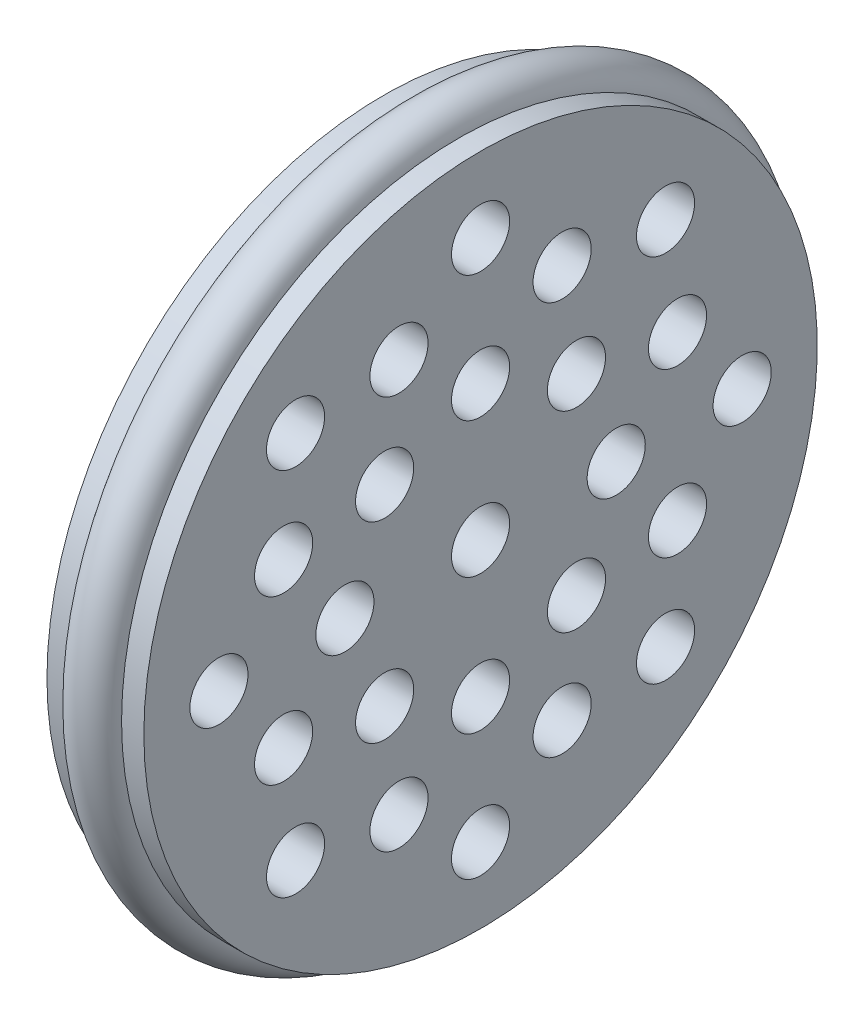
ISO-10303-21;
HEADER;
FILE_DESCRIPTION(('STEP AP214'),'2;1');
FILE_NAME('part.step','',(''),(''),'','','');
FILE_SCHEMA(('AUTOMOTIVE_DESIGN { 1 0 10303 214 1 1 1 1 }'));
ENDSEC;
DATA;
#1=APPLICATION_CONTEXT('core data for automotive mechanical design processes');
#2=APPLICATION_PROTOCOL_DEFINITION('international standard','automotive_design',2000,#1);
#3=PRODUCT_CONTEXT('',#1,'mechanical');
#4=PRODUCT('Part','Part','',(#3));
#5=PRODUCT_RELATED_PRODUCT_CATEGORY('part','',(#4));
#6=PRODUCT_DEFINITION_FORMATION('','',#4);
#7=PRODUCT_DEFINITION_CONTEXT('part definition',#1,'design');
#8=PRODUCT_DEFINITION('design','',#6,#7);
#9=PRODUCT_DEFINITION_SHAPE('','',#8);
#10=(LENGTH_UNIT() NAMED_UNIT(*) SI_UNIT(.MILLI.,.METRE.));
#11=(NAMED_UNIT(*) PLANE_ANGLE_UNIT() SI_UNIT($,.RADIAN.));
#12=(NAMED_UNIT(*) SI_UNIT($,.STERADIAN.) SOLID_ANGLE_UNIT());
#13=UNCERTAINTY_MEASURE_WITH_UNIT(LENGTH_MEASURE(1.E-05),#10,'distance_accuracy_value','');
#14=(GEOMETRIC_REPRESENTATION_CONTEXT(3) GLOBAL_UNCERTAINTY_ASSIGNED_CONTEXT((#13)) GLOBAL_UNIT_ASSIGNED_CONTEXT((#10,
#11,#12)) REPRESENTATION_CONTEXT('',''));
#15=CARTESIAN_POINT('',(0.,0.,0.));
#16=DIRECTION('',(0.,0.,1.));
#17=DIRECTION('',(1.,0.,0.));
#18=AXIS2_PLACEMENT_3D('',#15,#16,#17);
#19=CARTESIAN_POINT('',(5.,0.,0.));
#20=DIRECTION('',(-1.,0.,0.));
#21=DIRECTION('',(0.,0.,1.));
#22=AXIS2_PLACEMENT_3D('',#19,#20,#21);
#23=TOROIDAL_SURFACE('',#22,34.3,2.7);
#24=CARTESIAN_POINT('',(5.,0.,37.));
#25=VERTEX_POINT('',#24);
#26=VERTEX_LOOP('',#25);
#27=FACE_BOUND('',#26,.T.);
#28=ADVANCED_FACE('F38',(#27),#23,.T.);
#29=CLOSED_SHELL('',(#28));
#30=MANIFOLD_SOLID_BREP('B2',#29);
#31=CARTESIAN_POINT('',(0.,34.75,0.));
#32=DIRECTION('',(1.,0.,0.));
#33=DIRECTION('',(0.,0.,-1.));
#34=AXIS2_PLACEMENT_3D('',#31,#32,#33);
#35=PLANE('',#34);
#36=CARTESIAN_POINT('',(0.,19.091883092037,-19.0918830920366));
#37=DIRECTION('',(1.,0.,0.));
#38=DIRECTION('',(0.,-0.707106781186539,-0.707106781186556));
#39=AXIS2_PLACEMENT_3D('',#36,#37,#38);
#40=CIRCLE('',#39,3.);
#41=CARTESIAN_POINT('',(0.,16.9705627484774,-21.2132034355962));
#42=VERTEX_POINT('',#41);
#43=EDGE_CURVE('E219',#42,#42,#40,.T.);
#44=ORIENTED_EDGE('',*,*,#43,.T.);
#45=EDGE_LOOP('',(#44));
#46=FACE_BOUND('',#45,.T.);
#47=CARTESIAN_POINT('',(0.,2.82809988446294E-13,-27.));
#48=DIRECTION('',(1.,0.,0.));
#49=DIRECTION('',(0.,-1.,0.));
#50=AXIS2_PLACEMENT_3D('',#47,#48,#49);
#51=CIRCLE('',#50,3.);
#52=CARTESIAN_POINT('',(0.,-2.99999999999972,-27.));
#53=VERTEX_POINT('',#52);
#54=EDGE_CURVE('E213',#53,#53,#51,.T.);
#55=ORIENTED_EDGE('',*,*,#54,.T.);
#56=EDGE_LOOP('',(#55));
#57=FACE_BOUND('',#56,.T.);
#58=CARTESIAN_POINT('',(0.,-19.0918830920366,-19.0918830920369));
#59=DIRECTION('',(1.,0.,0.));
#60=DIRECTION('',(0.,-0.707106781186554,0.707106781186541));
#61=AXIS2_PLACEMENT_3D('',#58,#59,#60);
#62=CIRCLE('',#61,3.);
#63=CARTESIAN_POINT('',(0.,-21.2132034355963,-16.9705627484773));
#64=VERTEX_POINT('',#63);
#65=EDGE_CURVE('E207',#64,#64,#62,.T.);
#66=ORIENTED_EDGE('',*,*,#65,.T.);
#67=EDGE_LOOP('',(#66));
#68=FACE_BOUND('',#67,.T.);
#69=CARTESIAN_POINT('',(0.,-27.,-1.88539992297529E-13));
#70=DIRECTION('',(1.,0.,0.));
#71=DIRECTION('',(0.,0.,1.));
#72=AXIS2_PLACEMENT_3D('',#69,#70,#71);
#73=CIRCLE('',#72,3.);
#74=CARTESIAN_POINT('',(0.,-27.,2.99999999999981));
#75=VERTEX_POINT('',#74);
#76=EDGE_CURVE('E201',#75,#75,#73,.T.);
#77=ORIENTED_EDGE('',*,*,#76,.T.);
#78=EDGE_LOOP('',(#77));
#79=FACE_BOUND('',#78,.T.);
#80=CARTESIAN_POINT('',(0.,-19.0918830920369,19.0918830920367));
#81=DIRECTION('',(1.,0.,0.));
#82=DIRECTION('',(0.,0.707106781186544,0.707106781186551));
#83=AXIS2_PLACEMENT_3D('',#80,#81,#82);
#84=CIRCLE('',#83,3.);
#85=CARTESIAN_POINT('',(0.,-16.9705627484772,21.2132034355963));
#86=VERTEX_POINT('',#85);
#87=EDGE_CURVE('E195',#86,#86,#84,.T.);
#88=ORIENTED_EDGE('',*,*,#87,.T.);
#89=EDGE_LOOP('',(#88));
#90=FACE_BOUND('',#89,.T.);
#91=CARTESIAN_POINT('',(0.,0.,27.));
#92=DIRECTION('',(1.,0.,0.));
#93=DIRECTION('',(0.,1.,0.));
#94=AXIS2_PLACEMENT_3D('',#91,#92,#93);
#95=CIRCLE('',#94,3.);
#96=CARTESIAN_POINT('',(0.,2.99999999999991,27.));
#97=VERTEX_POINT('',#96);
#98=EDGE_CURVE('E189',#97,#97,#95,.T.);
#99=ORIENTED_EDGE('',*,*,#98,.T.);
#100=EDGE_LOOP('',(#99));
#101=FACE_BOUND('',#100,.T.);
#102=CARTESIAN_POINT('',(0.,19.0918830920367,19.0918830920368));
#103=DIRECTION('',(1.,0.,0.));
#104=DIRECTION('',(0.,0.707106781186549,-0.707106781186546));
#105=AXIS2_PLACEMENT_3D('',#102,#103,#104);
#106=CIRCLE('',#105,3.);
#107=CARTESIAN_POINT('',(0.,21.2132034355964,16.9705627484772));
#108=VERTEX_POINT('',#107);
#109=EDGE_CURVE('E183',#108,#108,#106,.T.);
#110=ORIENTED_EDGE('',*,*,#109,.T.);
#111=EDGE_LOOP('',(#110));
#112=FACE_BOUND('',#111,.T.);
#113=CARTESIAN_POINT('',(0.,27.,0.));
#114=DIRECTION('',(1.,0.,0.));
#115=DIRECTION('',(0.,0.,-1.));
#116=AXIS2_PLACEMENT_3D('',#113,#114,#115);
#117=CIRCLE('',#116,3.);
#118=CARTESIAN_POINT('',(0.,27.,-3.));
#119=VERTEX_POINT('',#118);
#120=EDGE_CURVE('E177',#119,#119,#117,.T.);
#121=ORIENTED_EDGE('',*,*,#120,.T.);
#122=EDGE_LOOP('',(#121));
#123=FACE_BOUND('',#122,.T.);
#124=CARTESIAN_POINT('',(0.,20.3253497152484,-8.41903551203171));
#125=DIRECTION('',(1.,0.,0.));
#126=DIRECTION('',(0.,-0.707106781186539,-0.707106781186556));
#127=AXIS2_PLACEMENT_3D('',#124,#125,#126);
#128=CIRCLE('',#127,3.);
#129=CARTESIAN_POINT('',(0.,18.2040293716888,-10.5403558555914));
#130=VERTEX_POINT('',#129);
#131=EDGE_CURVE('E171',#130,#130,#128,.T.);
#132=ORIENTED_EDGE('',*,*,#131,.T.);
#133=EDGE_LOOP('',(#132));
#134=FACE_BOUND('',#133,.T.);
#135=CARTESIAN_POINT('',(0.,8.4190355120322,-20.3253497152482));
#136=DIRECTION('',(1.,0.,0.));
#137=DIRECTION('',(0.,-1.,0.));
#138=AXIS2_PLACEMENT_3D('',#135,#136,#137);
#139=CIRCLE('',#138,3.);
#140=CARTESIAN_POINT('',(0.,5.4190355120322,-20.3253497152482));
#141=VERTEX_POINT('',#140);
#142=EDGE_CURVE('E165',#141,#141,#139,.T.);
#143=ORIENTED_EDGE('',*,*,#142,.T.);
#144=EDGE_LOOP('',(#143));
#145=FACE_BOUND('',#144,.T.);
#146=CARTESIAN_POINT('',(0.,-8.41903551203178,-20.3253497152484));
#147=DIRECTION('',(1.,0.,0.));
#148=DIRECTION('',(0.,-0.707106781186554,0.707106781186541));
#149=AXIS2_PLACEMENT_3D('',#146,#147,#148);
#150=CIRCLE('',#149,3.);
#151=CARTESIAN_POINT('',(0.,-10.5403558555914,-18.2040293716888));
#152=VERTEX_POINT('',#151);
#153=EDGE_CURVE('E159',#152,#152,#150,.T.);
#154=ORIENTED_EDGE('',*,*,#153,.T.);
#155=EDGE_LOOP('',(#154));
#156=FACE_BOUND('',#155,.T.);
#157=CARTESIAN_POINT('',(0.,-20.3253497152482,-8.41903551203213));
#158=DIRECTION('',(1.,0.,0.));
#159=DIRECTION('',(0.,0.,1.));
#160=AXIS2_PLACEMENT_3D('',#157,#158,#159);
#161=CIRCLE('',#160,3.);
#162=CARTESIAN_POINT('',(0.,-20.3253497152483,-5.41903551203213));
#163=VERTEX_POINT('',#162);
#164=EDGE_CURVE('E153',#163,#163,#161,.T.);
#165=ORIENTED_EDGE('',*,*,#164,.T.);
#166=EDGE_LOOP('',(#165));
#167=FACE_BOUND('',#166,.T.);
#168=CARTESIAN_POINT('',(0.,-20.3253497152484,8.41903551203185));
#169=DIRECTION('',(1.,0.,0.));
#170=DIRECTION('',(0.,0.707106781186544,0.707106781186551));
#171=AXIS2_PLACEMENT_3D('',#168,#169,#170);
#172=CIRCLE('',#171,3.);
#173=CARTESIAN_POINT('',(0.,-18.2040293716887,10.5403558555915));
#174=VERTEX_POINT('',#173);
#175=EDGE_CURVE('E147',#174,#174,#172,.T.);
#176=ORIENTED_EDGE('',*,*,#175,.T.);
#177=EDGE_LOOP('',(#176));
#178=FACE_BOUND('',#177,.T.);
#179=CARTESIAN_POINT('',(0.,-8.41903551203206,20.3253497152483));
#180=DIRECTION('',(1.,0.,0.));
#181=DIRECTION('',(0.,1.,0.));
#182=AXIS2_PLACEMENT_3D('',#179,#180,#181);
#183=CIRCLE('',#182,3.);
#184=CARTESIAN_POINT('',(0.,-5.41903551203206,20.3253497152483));
#185=VERTEX_POINT('',#184);
#186=EDGE_CURVE('E141',#185,#185,#183,.T.);
#187=ORIENTED_EDGE('',*,*,#186,.T.);
#188=EDGE_LOOP('',(#187));
#189=FACE_BOUND('',#188,.T.);
#190=CARTESIAN_POINT('',(0.,8.41903551203193,20.3253497152483));
#191=DIRECTION('',(1.,0.,0.));
#192=DIRECTION('',(0.,0.707106781186549,-0.707106781186546));
#193=AXIS2_PLACEMENT_3D('',#190,#191,#192);
#194=CIRCLE('',#193,3.);
#195=CARTESIAN_POINT('',(0.,10.5403558555916,18.2040293716887));
#196=VERTEX_POINT('',#195);
#197=EDGE_CURVE('E135',#196,#196,#194,.T.);
#198=ORIENTED_EDGE('',*,*,#197,.T.);
#199=EDGE_LOOP('',(#198));
#200=FACE_BOUND('',#199,.T.);
#201=CARTESIAN_POINT('',(0.,20.3253497152483,8.41903551203199));
#202=DIRECTION('',(1.,0.,0.));
#203=DIRECTION('',(0.,0.,-1.));
#204=AXIS2_PLACEMENT_3D('',#201,#202,#203);
#205=CIRCLE('',#204,3.);
#206=CARTESIAN_POINT('',(0.,20.3253497152483,5.41903551203199));
#207=VERTEX_POINT('',#206);
#208=EDGE_CURVE('E129',#207,#207,#205,.T.);
#209=ORIENTED_EDGE('',*,*,#208,.T.);
#210=EDGE_LOOP('',(#209));
#211=FACE_BOUND('',#210,.T.);
#212=CARTESIAN_POINT('',(0.,9.89949493661179,-9.89949493661154));
#213=DIRECTION('',(1.,0.,0.));
#214=DIRECTION('',(0.,-0.707106781186539,-0.707106781186556));
#215=AXIS2_PLACEMENT_3D('',#212,#213,#214);
#216=CIRCLE('',#215,3.);
#217=CARTESIAN_POINT('',(0.,7.77817459305217,-12.0208152801712));
#218=VERTEX_POINT('',#217);
#219=EDGE_CURVE('E123',#218,#218,#216,.T.);
#220=ORIENTED_EDGE('',*,*,#219,.T.);
#221=EDGE_LOOP('',(#220));
#222=FACE_BOUND('',#221,.T.);
#223=CARTESIAN_POINT('',(0.,1.46642216231412E-13,-14.));
#224=DIRECTION('',(1.,0.,0.));
#225=DIRECTION('',(0.,-1.,0.));
#226=AXIS2_PLACEMENT_3D('',#223,#224,#225);
#227=CIRCLE('',#226,3.);
#228=CARTESIAN_POINT('',(0.,-2.99999999999985,-14.));
#229=VERTEX_POINT('',#228);
#230=EDGE_CURVE('E117',#229,#229,#227,.T.);
#231=ORIENTED_EDGE('',*,*,#230,.T.);
#232=EDGE_LOOP('',(#231));
#233=FACE_BOUND('',#232,.T.);
#234=CARTESIAN_POINT('',(0.,-9.89949493661158,-9.89949493661175));
#235=DIRECTION('',(1.,0.,0.));
#236=DIRECTION('',(0.,-0.707106781186554,0.707106781186541));
#237=AXIS2_PLACEMENT_3D('',#234,#235,#236);
#238=CIRCLE('',#237,3.);
#239=CARTESIAN_POINT('',(0.,-12.0208152801712,-7.77817459305213));
#240=VERTEX_POINT('',#239);
#241=EDGE_CURVE('E111',#240,#240,#238,.T.);
#242=ORIENTED_EDGE('',*,*,#241,.T.);
#243=EDGE_LOOP('',(#242));
#244=FACE_BOUND('',#243,.T.);
#245=CARTESIAN_POINT('',(0.,-14.,0.));
#246=DIRECTION('',(1.,0.,0.));
#247=DIRECTION('',(0.,0.,1.));
#248=AXIS2_PLACEMENT_3D('',#245,#246,#247);
#249=CIRCLE('',#248,3.);
#250=CARTESIAN_POINT('',(0.,-14.,2.9999999999999));
#251=VERTEX_POINT('',#250);
#252=EDGE_CURVE('E105',#251,#251,#249,.T.);
#253=ORIENTED_EDGE('',*,*,#252,.T.);
#254=EDGE_LOOP('',(#253));
#255=FACE_BOUND('',#254,.T.);
#256=CARTESIAN_POINT('',(0.,-9.89949493661172,9.89949493661161));
#257=DIRECTION('',(1.,0.,0.));
#258=DIRECTION('',(0.,0.707106781186544,0.707106781186551));
#259=AXIS2_PLACEMENT_3D('',#256,#257,#258);
#260=CIRCLE('',#259,3.);
#261=CARTESIAN_POINT('',(0.,-7.77817459305209,12.0208152801713));
#262=VERTEX_POINT('',#261);
#263=EDGE_CURVE('E99',#262,#262,#260,.T.);
#264=ORIENTED_EDGE('',*,*,#263,.T.);
#265=EDGE_LOOP('',(#264));
#266=FACE_BOUND('',#265,.T.);
#267=CARTESIAN_POINT('',(0.,0.,14.));
#268=DIRECTION('',(1.,0.,0.));
#269=DIRECTION('',(0.,1.,0.));
#270=AXIS2_PLACEMENT_3D('',#267,#268,#269);
#271=CIRCLE('',#270,3.);
#272=CARTESIAN_POINT('',(0.,2.99999999999995,14.));
#273=VERTEX_POINT('',#272);
#274=EDGE_CURVE('E93',#273,#273,#271,.T.);
#275=ORIENTED_EDGE('',*,*,#274,.T.);
#276=EDGE_LOOP('',(#275));
#277=FACE_BOUND('',#276,.T.);
#278=CARTESIAN_POINT('',(0.,9.89949493661165,9.89949493661168));
#279=DIRECTION('',(1.,0.,0.));
#280=DIRECTION('',(0.,0.707106781186549,-0.707106781186546));
#281=AXIS2_PLACEMENT_3D('',#278,#279,#280);
#282=CIRCLE('',#281,3.);
#283=CARTESIAN_POINT('',(0.,12.0208152801713,7.77817459305204));
#284=VERTEX_POINT('',#283);
#285=EDGE_CURVE('E87',#284,#284,#282,.T.);
#286=ORIENTED_EDGE('',*,*,#285,.T.);
#287=EDGE_LOOP('',(#286));
#288=FACE_BOUND('',#287,.T.);
#289=CARTESIAN_POINT('',(0.,14.,0.));
#290=DIRECTION('',(1.,0.,0.));
#291=DIRECTION('',(0.,0.,-1.));
#292=AXIS2_PLACEMENT_3D('',#289,#290,#291);
#293=CIRCLE('',#292,3.);
#294=CARTESIAN_POINT('',(0.,14.,-3.));
#295=VERTEX_POINT('',#294);
#296=EDGE_CURVE('E81',#295,#295,#293,.T.);
#297=ORIENTED_EDGE('',*,*,#296,.T.);
#298=EDGE_LOOP('',(#297));
#299=FACE_BOUND('',#298,.T.);
#300=CARTESIAN_POINT('',(0.,0.,0.));
#301=DIRECTION('',(1.,0.,0.));
#302=DIRECTION('',(0.,0.,-1.));
#303=AXIS2_PLACEMENT_3D('',#300,#301,#302);
#304=CIRCLE('',#303,3.);
#305=CARTESIAN_POINT('',(0.,0.,-3.));
#306=VERTEX_POINT('',#305);
#307=EDGE_CURVE('E77',#306,#306,#304,.T.);
#308=ORIENTED_EDGE('',*,*,#307,.T.);
#309=EDGE_LOOP('',(#308));
#310=FACE_BOUND('',#309,.T.);
#311=CARTESIAN_POINT('',(0.,0.,0.));
#312=DIRECTION('',(-1.,0.,0.));
#313=DIRECTION('',(0.,0.,1.));
#314=AXIS2_PLACEMENT_3D('',#311,#312,#313);
#315=CIRCLE('',#314,34.75);
#316=CARTESIAN_POINT('',(0.,0.,34.75));
#317=VERTEX_POINT('',#316);
#318=EDGE_CURVE('E37',#317,#317,#315,.T.);
#319=ORIENTED_EDGE('',*,*,#318,.T.);
#320=EDGE_LOOP('',(#319));
#321=FACE_BOUND('',#320,.T.);
#322=ADVANCED_FACE('F52',(#46,#57,#68,#79,#90,#101,#112,#123,#134,#145,#156,#167,#178,#189,#200,
#211,#222,#233,#244,#255,#266,#277,#288,#299,#310,#321),#35,.F.);
#323=CARTESIAN_POINT('',(-55.4817992011619,0.,0.));
#324=DIRECTION('',(-1.,0.,0.));
#325=DIRECTION('',(0.,0.,1.));
#326=AXIS2_PLACEMENT_3D('',#323,#324,#325);
#327=CYLINDRICAL_SURFACE('',#326,34.75);
#328=ORIENTED_EDGE('',*,*,#318,.F.);
#329=EDGE_LOOP('',(#328));
#330=FACE_BOUND('',#329,.T.);
#331=CARTESIAN_POINT('',(2.3,0.,0.));
#332=DIRECTION('',(-1.,0.,0.));
#333=DIRECTION('',(0.,0.,1.));
#334=AXIS2_PLACEMENT_3D('',#331,#332,#333);
#335=CIRCLE('',#334,34.75);
#336=CARTESIAN_POINT('',(2.3,0.,34.75));
#337=VERTEX_POINT('',#336);
#338=EDGE_CURVE('E58',#337,#337,#335,.T.);
#339=ORIENTED_EDGE('',*,*,#338,.T.);
#340=EDGE_LOOP('',(#339));
#341=FACE_BOUND('',#340,.T.);
#342=ADVANCED_FACE('F305',(#330,#341),#327,.T.);
#343=CARTESIAN_POINT('',(2.3,34.75,0.));
#344=DIRECTION('',(-1.,0.,0.));
#345=DIRECTION('',(0.,0.,1.));
#346=AXIS2_PLACEMENT_3D('',#343,#344,#345);
#347=PLANE('',#346);
#348=ORIENTED_EDGE('',*,*,#338,.F.);
#349=EDGE_LOOP('',(#348));
#350=FACE_BOUND('',#349,.T.);
#351=CARTESIAN_POINT('',(2.3,0.,0.));
#352=DIRECTION('',(-1.,0.,0.));
#353=DIRECTION('',(0.,0.,1.));
#354=AXIS2_PLACEMENT_3D('',#351,#352,#353);
#355=CIRCLE('',#354,31.75);
#356=CARTESIAN_POINT('',(2.3,0.,31.75));
#357=VERTEX_POINT('',#356);
#358=EDGE_CURVE('E62',#357,#357,#355,.T.);
#359=ORIENTED_EDGE('',*,*,#358,.T.);
#360=EDGE_LOOP('',(#359));
#361=FACE_BOUND('',#360,.T.);
#362=ADVANCED_FACE('F309',(#350,#361),#347,.F.);
#363=CARTESIAN_POINT('',(-55.4817992011619,0.,0.));
#364=DIRECTION('',(-1.,0.,0.));
#365=DIRECTION('',(0.,0.,1.));
#366=AXIS2_PLACEMENT_3D('',#363,#364,#365);
#367=CYLINDRICAL_SURFACE('',#366,31.75);
#368=ORIENTED_EDGE('',*,*,#358,.F.);
#369=EDGE_LOOP('',(#368));
#370=FACE_BOUND('',#369,.T.);
#371=CARTESIAN_POINT('',(7.7,0.,0.));
#372=DIRECTION('',(-1.,0.,0.));
#373=DIRECTION('',(0.,0.,1.));
#374=AXIS2_PLACEMENT_3D('',#371,#372,#373);
#375=CIRCLE('',#374,31.75);
#376=CARTESIAN_POINT('',(7.7,0.,31.75));
#377=VERTEX_POINT('',#376);
#378=EDGE_CURVE('E66',#377,#377,#375,.T.);
#379=ORIENTED_EDGE('',*,*,#378,.T.);
#380=EDGE_LOOP('',(#379));
#381=FACE_BOUND('',#380,.T.);
#382=ADVANCED_FACE('F300',(#370,#381),#367,.T.);
#383=CARTESIAN_POINT('',(7.7,31.75,0.));
#384=DIRECTION('',(1.,0.,0.));
#385=DIRECTION('',(0.,0.,-1.));
#386=AXIS2_PLACEMENT_3D('',#383,#384,#385);
#387=PLANE('',#386);
#388=ORIENTED_EDGE('',*,*,#378,.F.);
#389=EDGE_LOOP('',(#388));
#390=FACE_BOUND('',#389,.T.);
#391=CARTESIAN_POINT('',(7.7,0.,0.));
#392=DIRECTION('',(-1.,0.,0.));
#393=DIRECTION('',(0.,0.,1.));
#394=AXIS2_PLACEMENT_3D('',#391,#392,#393);
#395=CIRCLE('',#394,34.75);
#396=CARTESIAN_POINT('',(7.7,0.,34.75));
#397=VERTEX_POINT('',#396);
#398=EDGE_CURVE('E71',#397,#397,#395,.T.);
#399=ORIENTED_EDGE('',*,*,#398,.T.);
#400=EDGE_LOOP('',(#399));
#401=FACE_BOUND('',#400,.T.);
#402=ADVANCED_FACE('F294',(#390,#401),#387,.F.);
#403=CARTESIAN_POINT('',(-55.4817992011619,0.,0.));
#404=DIRECTION('',(-1.,0.,0.));
#405=DIRECTION('',(0.,0.,1.));
#406=AXIS2_PLACEMENT_3D('',#403,#404,#405);
#407=CYLINDRICAL_SURFACE('',#406,34.75);
#408=ORIENTED_EDGE('',*,*,#398,.F.);
#409=EDGE_LOOP('',(#408));
#410=FACE_BOUND('',#409,.T.);
#411=CARTESIAN_POINT('',(10.,0.,0.));
#412=DIRECTION('',(-1.,0.,0.));
#413=DIRECTION('',(0.,0.,1.));
#414=AXIS2_PLACEMENT_3D('',#411,#412,#413);
#415=CIRCLE('',#414,34.75);
#416=CARTESIAN_POINT('',(10.,0.,34.75));
#417=VERTEX_POINT('',#416);
#418=EDGE_CURVE('E74',#417,#417,#415,.T.);
#419=ORIENTED_EDGE('',*,*,#418,.T.);
#420=EDGE_LOOP('',(#419));
#421=FACE_BOUND('',#420,.T.);
#422=ADVANCED_FACE('F241',(#410,#421),#407,.T.);
#423=CARTESIAN_POINT('',(10.,34.75,0.));
#424=DIRECTION('',(-1.,0.,0.));
#425=DIRECTION('',(0.,0.,1.));
#426=AXIS2_PLACEMENT_3D('',#423,#424,#425);
#427=PLANE('',#426);
#428=CARTESIAN_POINT('',(10.,19.091883092037,-19.0918830920366));
#429=DIRECTION('',(1.,0.,0.));
#430=DIRECTION('',(0.,-0.707106781186539,-0.707106781186556));
#431=AXIS2_PLACEMENT_3D('',#428,#429,#430);
#432=CIRCLE('',#431,3.);
#433=CARTESIAN_POINT('',(10.,16.9705627484774,-21.2132034355962));
#434=VERTEX_POINT('',#433);
#435=EDGE_CURVE('E222',#434,#434,#432,.T.);
#436=ORIENTED_EDGE('',*,*,#435,.F.);
#437=EDGE_LOOP('',(#436));
#438=FACE_BOUND('',#437,.T.);
#439=CARTESIAN_POINT('',(10.,2.82809988446294E-13,-27.));
#440=DIRECTION('',(1.,0.,0.));
#441=DIRECTION('',(0.,-1.,0.));
#442=AXIS2_PLACEMENT_3D('',#439,#440,#441);
#443=CIRCLE('',#442,3.);
#444=CARTESIAN_POINT('',(10.,-2.99999999999972,-27.));
#445=VERTEX_POINT('',#444);
#446=EDGE_CURVE('E216',#445,#445,#443,.T.);
#447=ORIENTED_EDGE('',*,*,#446,.F.);
#448=EDGE_LOOP('',(#447));
#449=FACE_BOUND('',#448,.T.);
#450=CARTESIAN_POINT('',(10.,-19.0918830920366,-19.0918830920369));
#451=DIRECTION('',(1.,0.,0.));
#452=DIRECTION('',(0.,-0.707106781186554,0.707106781186541));
#453=AXIS2_PLACEMENT_3D('',#450,#451,#452);
#454=CIRCLE('',#453,3.);
#455=CARTESIAN_POINT('',(10.,-21.2132034355963,-16.9705627484773));
#456=VERTEX_POINT('',#455);
#457=EDGE_CURVE('E210',#456,#456,#454,.T.);
#458=ORIENTED_EDGE('',*,*,#457,.F.);
#459=EDGE_LOOP('',(#458));
#460=FACE_BOUND('',#459,.T.);
#461=CARTESIAN_POINT('',(10.,-27.,-1.88539992297529E-13));
#462=DIRECTION('',(1.,0.,0.));
#463=DIRECTION('',(0.,0.,1.));
#464=AXIS2_PLACEMENT_3D('',#461,#462,#463);
#465=CIRCLE('',#464,3.);
#466=CARTESIAN_POINT('',(10.,-27.,2.99999999999981));
#467=VERTEX_POINT('',#466);
#468=EDGE_CURVE('E204',#467,#467,#465,.T.);
#469=ORIENTED_EDGE('',*,*,#468,.F.);
#470=EDGE_LOOP('',(#469));
#471=FACE_BOUND('',#470,.T.);
#472=CARTESIAN_POINT('',(10.,-19.0918830920369,19.0918830920367));
#473=DIRECTION('',(1.,0.,0.));
#474=DIRECTION('',(0.,0.707106781186544,0.707106781186551));
#475=AXIS2_PLACEMENT_3D('',#472,#473,#474);
#476=CIRCLE('',#475,3.);
#477=CARTESIAN_POINT('',(10.,-16.9705627484772,21.2132034355963));
#478=VERTEX_POINT('',#477);
#479=EDGE_CURVE('E198',#478,#478,#476,.T.);
#480=ORIENTED_EDGE('',*,*,#479,.F.);
#481=EDGE_LOOP('',(#480));
#482=FACE_BOUND('',#481,.T.);
#483=CARTESIAN_POINT('',(10.,0.,27.));
#484=DIRECTION('',(1.,0.,0.));
#485=DIRECTION('',(0.,1.,0.));
#486=AXIS2_PLACEMENT_3D('',#483,#484,#485);
#487=CIRCLE('',#486,3.);
#488=CARTESIAN_POINT('',(10.,2.99999999999991,27.));
#489=VERTEX_POINT('',#488);
#490=EDGE_CURVE('E192',#489,#489,#487,.T.);
#491=ORIENTED_EDGE('',*,*,#490,.F.);
#492=EDGE_LOOP('',(#491));
#493=FACE_BOUND('',#492,.T.);
#494=CARTESIAN_POINT('',(10.,19.0918830920367,19.0918830920368));
#495=DIRECTION('',(1.,0.,0.));
#496=DIRECTION('',(0.,0.707106781186549,-0.707106781186546));
#497=AXIS2_PLACEMENT_3D('',#494,#495,#496);
#498=CIRCLE('',#497,3.);
#499=CARTESIAN_POINT('',(10.,21.2132034355964,16.9705627484772));
#500=VERTEX_POINT('',#499);
#501=EDGE_CURVE('E186',#500,#500,#498,.T.);
#502=ORIENTED_EDGE('',*,*,#501,.F.);
#503=EDGE_LOOP('',(#502));
#504=FACE_BOUND('',#503,.T.);
#505=CARTESIAN_POINT('',(10.,27.,0.));
#506=DIRECTION('',(1.,0.,0.));
#507=DIRECTION('',(0.,0.,-1.));
#508=AXIS2_PLACEMENT_3D('',#505,#506,#507);
#509=CIRCLE('',#508,3.);
#510=CARTESIAN_POINT('',(10.,27.,-3.));
#511=VERTEX_POINT('',#510);
#512=EDGE_CURVE('E180',#511,#511,#509,.T.);
#513=ORIENTED_EDGE('',*,*,#512,.F.);
#514=EDGE_LOOP('',(#513));
#515=FACE_BOUND('',#514,.T.);
#516=CARTESIAN_POINT('',(10.,20.3253497152484,-8.41903551203171));
#517=DIRECTION('',(1.,0.,0.));
#518=DIRECTION('',(0.,-0.707106781186539,-0.707106781186556));
#519=AXIS2_PLACEMENT_3D('',#516,#517,#518);
#520=CIRCLE('',#519,3.);
#521=CARTESIAN_POINT('',(10.,18.2040293716888,-10.5403558555914));
#522=VERTEX_POINT('',#521);
#523=EDGE_CURVE('E174',#522,#522,#520,.T.);
#524=ORIENTED_EDGE('',*,*,#523,.F.);
#525=EDGE_LOOP('',(#524));
#526=FACE_BOUND('',#525,.T.);
#527=CARTESIAN_POINT('',(10.,8.4190355120322,-20.3253497152482));
#528=DIRECTION('',(1.,0.,0.));
#529=DIRECTION('',(0.,-1.,0.));
#530=AXIS2_PLACEMENT_3D('',#527,#528,#529);
#531=CIRCLE('',#530,3.);
#532=CARTESIAN_POINT('',(10.,5.4190355120322,-20.3253497152482));
#533=VERTEX_POINT('',#532);
#534=EDGE_CURVE('E168',#533,#533,#531,.T.);
#535=ORIENTED_EDGE('',*,*,#534,.F.);
#536=EDGE_LOOP('',(#535));
#537=FACE_BOUND('',#536,.T.);
#538=CARTESIAN_POINT('',(10.,-8.41903551203178,-20.3253497152484));
#539=DIRECTION('',(1.,0.,0.));
#540=DIRECTION('',(0.,-0.707106781186554,0.707106781186541));
#541=AXIS2_PLACEMENT_3D('',#538,#539,#540);
#542=CIRCLE('',#541,3.);
#543=CARTESIAN_POINT('',(10.,-10.5403558555914,-18.2040293716888));
#544=VERTEX_POINT('',#543);
#545=EDGE_CURVE('E162',#544,#544,#542,.T.);
#546=ORIENTED_EDGE('',*,*,#545,.F.);
#547=EDGE_LOOP('',(#546));
#548=FACE_BOUND('',#547,.T.);
#549=CARTESIAN_POINT('',(10.,-20.3253497152482,-8.41903551203213));
#550=DIRECTION('',(1.,0.,0.));
#551=DIRECTION('',(0.,0.,1.));
#552=AXIS2_PLACEMENT_3D('',#549,#550,#551);
#553=CIRCLE('',#552,3.);
#554=CARTESIAN_POINT('',(10.,-20.3253497152483,-5.41903551203213));
#555=VERTEX_POINT('',#554);
#556=EDGE_CURVE('E156',#555,#555,#553,.T.);
#557=ORIENTED_EDGE('',*,*,#556,.F.);
#558=EDGE_LOOP('',(#557));
#559=FACE_BOUND('',#558,.T.);
#560=CARTESIAN_POINT('',(10.,-20.3253497152484,8.41903551203185));
#561=DIRECTION('',(1.,0.,0.));
#562=DIRECTION('',(0.,0.707106781186544,0.707106781186551));
#563=AXIS2_PLACEMENT_3D('',#560,#561,#562);
#564=CIRCLE('',#563,3.);
#565=CARTESIAN_POINT('',(10.,-18.2040293716887,10.5403558555915));
#566=VERTEX_POINT('',#565);
#567=EDGE_CURVE('E150',#566,#566,#564,.T.);
#568=ORIENTED_EDGE('',*,*,#567,.F.);
#569=EDGE_LOOP('',(#568));
#570=FACE_BOUND('',#569,.T.);
#571=CARTESIAN_POINT('',(10.,-8.41903551203206,20.3253497152483));
#572=DIRECTION('',(1.,0.,0.));
#573=DIRECTION('',(0.,1.,0.));
#574=AXIS2_PLACEMENT_3D('',#571,#572,#573);
#575=CIRCLE('',#574,3.);
#576=CARTESIAN_POINT('',(10.,-5.41903551203206,20.3253497152483));
#577=VERTEX_POINT('',#576);
#578=EDGE_CURVE('E144',#577,#577,#575,.T.);
#579=ORIENTED_EDGE('',*,*,#578,.F.);
#580=EDGE_LOOP('',(#579));
#581=FACE_BOUND('',#580,.T.);
#582=CARTESIAN_POINT('',(10.,8.41903551203193,20.3253497152483));
#583=DIRECTION('',(1.,0.,0.));
#584=DIRECTION('',(0.,0.707106781186549,-0.707106781186546));
#585=AXIS2_PLACEMENT_3D('',#582,#583,#584);
#586=CIRCLE('',#585,3.);
#587=CARTESIAN_POINT('',(10.,10.5403558555916,18.2040293716887));
#588=VERTEX_POINT('',#587);
#589=EDGE_CURVE('E138',#588,#588,#586,.T.);
#590=ORIENTED_EDGE('',*,*,#589,.F.);
#591=EDGE_LOOP('',(#590));
#592=FACE_BOUND('',#591,.T.);
#593=CARTESIAN_POINT('',(10.,20.3253497152483,8.41903551203199));
#594=DIRECTION('',(1.,0.,0.));
#595=DIRECTION('',(0.,0.,-1.));
#596=AXIS2_PLACEMENT_3D('',#593,#594,#595);
#597=CIRCLE('',#596,3.);
#598=CARTESIAN_POINT('',(10.,20.3253497152483,5.41903551203199));
#599=VERTEX_POINT('',#598);
#600=EDGE_CURVE('E132',#599,#599,#597,.T.);
#601=ORIENTED_EDGE('',*,*,#600,.F.);
#602=EDGE_LOOP('',(#601));
#603=FACE_BOUND('',#602,.T.);
#604=CARTESIAN_POINT('',(10.,9.89949493661179,-9.89949493661154));
#605=DIRECTION('',(1.,0.,0.));
#606=DIRECTION('',(0.,-0.707106781186539,-0.707106781186556));
#607=AXIS2_PLACEMENT_3D('',#604,#605,#606);
#608=CIRCLE('',#607,3.);
#609=CARTESIAN_POINT('',(10.,7.77817459305217,-12.0208152801712));
#610=VERTEX_POINT('',#609);
#611=EDGE_CURVE('E126',#610,#610,#608,.T.);
#612=ORIENTED_EDGE('',*,*,#611,.F.);
#613=EDGE_LOOP('',(#612));
#614=FACE_BOUND('',#613,.T.);
#615=CARTESIAN_POINT('',(10.,1.46642216231412E-13,-14.));
#616=DIRECTION('',(1.,0.,0.));
#617=DIRECTION('',(0.,-1.,0.));
#618=AXIS2_PLACEMENT_3D('',#615,#616,#617);
#619=CIRCLE('',#618,3.);
#620=CARTESIAN_POINT('',(10.,-2.99999999999985,-14.));
#621=VERTEX_POINT('',#620);
#622=EDGE_CURVE('E120',#621,#621,#619,.T.);
#623=ORIENTED_EDGE('',*,*,#622,.F.);
#624=EDGE_LOOP('',(#623));
#625=FACE_BOUND('',#624,.T.);
#626=CARTESIAN_POINT('',(10.,-9.89949493661158,-9.89949493661175));
#627=DIRECTION('',(1.,0.,0.));
#628=DIRECTION('',(0.,-0.707106781186554,0.707106781186541));
#629=AXIS2_PLACEMENT_3D('',#626,#627,#628);
#630=CIRCLE('',#629,3.);
#631=CARTESIAN_POINT('',(10.,-12.0208152801712,-7.77817459305213));
#632=VERTEX_POINT('',#631);
#633=EDGE_CURVE('E114',#632,#632,#630,.T.);
#634=ORIENTED_EDGE('',*,*,#633,.F.);
#635=EDGE_LOOP('',(#634));
#636=FACE_BOUND('',#635,.T.);
#637=CARTESIAN_POINT('',(10.,-14.,0.));
#638=DIRECTION('',(1.,0.,0.));
#639=DIRECTION('',(0.,0.,1.));
#640=AXIS2_PLACEMENT_3D('',#637,#638,#639);
#641=CIRCLE('',#640,3.);
#642=CARTESIAN_POINT('',(10.,-14.,2.9999999999999));
#643=VERTEX_POINT('',#642);
#644=EDGE_CURVE('E108',#643,#643,#641,.T.);
#645=ORIENTED_EDGE('',*,*,#644,.F.);
#646=EDGE_LOOP('',(#645));
#647=FACE_BOUND('',#646,.T.);
#648=CARTESIAN_POINT('',(10.,-9.89949493661172,9.89949493661161));
#649=DIRECTION('',(1.,0.,0.));
#650=DIRECTION('',(0.,0.707106781186544,0.707106781186551));
#651=AXIS2_PLACEMENT_3D('',#648,#649,#650);
#652=CIRCLE('',#651,3.);
#653=CARTESIAN_POINT('',(10.,-7.77817459305209,12.0208152801713));
#654=VERTEX_POINT('',#653);
#655=EDGE_CURVE('E102',#654,#654,#652,.T.);
#656=ORIENTED_EDGE('',*,*,#655,.F.);
#657=EDGE_LOOP('',(#656));
#658=FACE_BOUND('',#657,.T.);
#659=CARTESIAN_POINT('',(10.,0.,14.));
#660=DIRECTION('',(1.,0.,0.));
#661=DIRECTION('',(0.,1.,0.));
#662=AXIS2_PLACEMENT_3D('',#659,#660,#661);
#663=CIRCLE('',#662,3.);
#664=CARTESIAN_POINT('',(10.,2.99999999999995,14.));
#665=VERTEX_POINT('',#664);
#666=EDGE_CURVE('E96',#665,#665,#663,.T.);
#667=ORIENTED_EDGE('',*,*,#666,.F.);
#668=EDGE_LOOP('',(#667));
#669=FACE_BOUND('',#668,.T.);
#670=CARTESIAN_POINT('',(10.,9.89949493661165,9.89949493661168));
#671=DIRECTION('',(1.,0.,0.));
#672=DIRECTION('',(0.,0.707106781186549,-0.707106781186546));
#673=AXIS2_PLACEMENT_3D('',#670,#671,#672);
#674=CIRCLE('',#673,3.);
#675=CARTESIAN_POINT('',(10.,12.0208152801713,7.77817459305204));
#676=VERTEX_POINT('',#675);
#677=EDGE_CURVE('E90',#676,#676,#674,.T.);
#678=ORIENTED_EDGE('',*,*,#677,.F.);
#679=EDGE_LOOP('',(#678));
#680=FACE_BOUND('',#679,.T.);
#681=CARTESIAN_POINT('',(10.,14.,0.));
#682=DIRECTION('',(1.,0.,0.));
#683=DIRECTION('',(0.,0.,-1.));
#684=AXIS2_PLACEMENT_3D('',#681,#682,#683);
#685=CIRCLE('',#684,3.);
#686=CARTESIAN_POINT('',(10.,14.,-3.));
#687=VERTEX_POINT('',#686);
#688=EDGE_CURVE('E84',#687,#687,#685,.T.);
#689=ORIENTED_EDGE('',*,*,#688,.F.);
#690=EDGE_LOOP('',(#689));
#691=FACE_BOUND('',#690,.T.);
#692=CARTESIAN_POINT('',(10.,0.,0.));
#693=DIRECTION('',(1.,0.,0.));
#694=DIRECTION('',(0.,0.,-1.));
#695=AXIS2_PLACEMENT_3D('',#692,#693,#694);
#696=CIRCLE('',#695,3.);
#697=CARTESIAN_POINT('',(10.,0.,-3.));
#698=VERTEX_POINT('',#697);
#699=EDGE_CURVE('E78',#698,#698,#696,.T.);
#700=ORIENTED_EDGE('',*,*,#699,.F.);
#701=EDGE_LOOP('',(#700));
#702=FACE_BOUND('',#701,.T.);
#703=ORIENTED_EDGE('',*,*,#418,.F.);
#704=EDGE_LOOP('',(#703));
#705=FACE_BOUND('',#704,.T.);
#706=ADVANCED_FACE('F237',(#438,#449,#460,#471,#482,#493,#504,#515,#526,#537,#548,#559,#570,
#581,#592,#603,#614,#625,#636,#647,#658,#669,#680,#691,#702,#705),#427,.F.);
#707=CARTESIAN_POINT('',(0.,0.,0.));
#708=DIRECTION('',(1.,0.,0.));
#709=DIRECTION('',(0.,0.,-1.));
#710=AXIS2_PLACEMENT_3D('',#707,#708,#709);
#711=CYLINDRICAL_SURFACE('',#710,3.);
#712=ORIENTED_EDGE('',*,*,#307,.F.);
#713=EDGE_LOOP('',(#712));
#714=FACE_BOUND('',#713,.T.);
#715=ORIENTED_EDGE('',*,*,#699,.T.);
#716=EDGE_LOOP('',(#715));
#717=FACE_BOUND('',#716,.T.);
#718=ADVANCED_FACE('F240',(#714,#717),#711,.F.);
#719=CARTESIAN_POINT('',(0.,14.,0.));
#720=DIRECTION('',(1.,0.,0.));
#721=DIRECTION('',(0.,0.,-1.));
#722=AXIS2_PLACEMENT_3D('',#719,#720,#721);
#723=CYLINDRICAL_SURFACE('',#722,3.);
#724=ORIENTED_EDGE('',*,*,#296,.F.);
#725=EDGE_LOOP('',(#724));
#726=FACE_BOUND('',#725,.T.);
#727=ORIENTED_EDGE('',*,*,#688,.T.);
#728=EDGE_LOOP('',(#727));
#729=FACE_BOUND('',#728,.T.);
#730=ADVANCED_FACE('F348',(#726,#729),#723,.F.);
#731=CARTESIAN_POINT('',(0.,9.89949493661165,9.89949493661168));
#732=DIRECTION('',(1.,0.,0.));
#733=DIRECTION('',(0.,0.,-1.));
#734=AXIS2_PLACEMENT_3D('',#731,#732,#733);
#735=CYLINDRICAL_SURFACE('',#734,3.);
#736=ORIENTED_EDGE('',*,*,#285,.F.);
#737=EDGE_LOOP('',(#736));
#738=FACE_BOUND('',#737,.T.);
#739=ORIENTED_EDGE('',*,*,#677,.T.);
#740=EDGE_LOOP('',(#739));
#741=FACE_BOUND('',#740,.T.);
#742=ADVANCED_FACE('F358',(#738,#741),#735,.F.);
#743=CARTESIAN_POINT('',(0.,0.,14.));
#744=DIRECTION('',(1.,0.,0.));
#745=DIRECTION('',(0.,0.,-1.));
#746=AXIS2_PLACEMENT_3D('',#743,#744,#745);
#747=CYLINDRICAL_SURFACE('',#746,3.);
#748=ORIENTED_EDGE('',*,*,#274,.F.);
#749=EDGE_LOOP('',(#748));
#750=FACE_BOUND('',#749,.T.);
#751=ORIENTED_EDGE('',*,*,#666,.T.);
#752=EDGE_LOOP('',(#751));
#753=FACE_BOUND('',#752,.T.);
#754=ADVANCED_FACE('F368',(#750,#753),#747,.F.);
#755=CARTESIAN_POINT('',(0.,-9.89949493661172,9.89949493661161));
#756=DIRECTION('',(1.,0.,0.));
#757=DIRECTION('',(0.,0.,-1.));
#758=AXIS2_PLACEMENT_3D('',#755,#756,#757);
#759=CYLINDRICAL_SURFACE('',#758,3.);
#760=ORIENTED_EDGE('',*,*,#263,.F.);
#761=EDGE_LOOP('',(#760));
#762=FACE_BOUND('',#761,.T.);
#763=ORIENTED_EDGE('',*,*,#655,.T.);
#764=EDGE_LOOP('',(#763));
#765=FACE_BOUND('',#764,.T.);
#766=ADVANCED_FACE('F378',(#762,#765),#759,.F.);
#767=CARTESIAN_POINT('',(0.,-14.,0.));
#768=DIRECTION('',(1.,0.,0.));
#769=DIRECTION('',(0.,0.,-1.));
#770=AXIS2_PLACEMENT_3D('',#767,#768,#769);
#771=CYLINDRICAL_SURFACE('',#770,3.);
#772=ORIENTED_EDGE('',*,*,#252,.F.);
#773=EDGE_LOOP('',(#772));
#774=FACE_BOUND('',#773,.T.);
#775=ORIENTED_EDGE('',*,*,#644,.T.);
#776=EDGE_LOOP('',(#775));
#777=FACE_BOUND('',#776,.T.);
#778=ADVANCED_FACE('F388',(#774,#777),#771,.F.);
#779=CARTESIAN_POINT('',(0.,-9.89949493661158,-9.89949493661175));
#780=DIRECTION('',(1.,0.,0.));
#781=DIRECTION('',(0.,0.,-1.));
#782=AXIS2_PLACEMENT_3D('',#779,#780,#781);
#783=CYLINDRICAL_SURFACE('',#782,3.);
#784=ORIENTED_EDGE('',*,*,#241,.F.);
#785=EDGE_LOOP('',(#784));
#786=FACE_BOUND('',#785,.T.);
#787=ORIENTED_EDGE('',*,*,#633,.T.);
#788=EDGE_LOOP('',(#787));
#789=FACE_BOUND('',#788,.T.);
#790=ADVANCED_FACE('F398',(#786,#789),#783,.F.);
#791=CARTESIAN_POINT('',(0.,1.46642216231412E-13,-14.));
#792=DIRECTION('',(1.,0.,0.));
#793=DIRECTION('',(0.,0.,-1.));
#794=AXIS2_PLACEMENT_3D('',#791,#792,#793);
#795=CYLINDRICAL_SURFACE('',#794,3.);
#796=ORIENTED_EDGE('',*,*,#230,.F.);
#797=EDGE_LOOP('',(#796));
#798=FACE_BOUND('',#797,.T.);
#799=ORIENTED_EDGE('',*,*,#622,.T.);
#800=EDGE_LOOP('',(#799));
#801=FACE_BOUND('',#800,.T.);
#802=ADVANCED_FACE('F408',(#798,#801),#795,.F.);
#803=CARTESIAN_POINT('',(0.,9.89949493661179,-9.89949493661154));
#804=DIRECTION('',(1.,0.,0.));
#805=DIRECTION('',(0.,0.,-1.));
#806=AXIS2_PLACEMENT_3D('',#803,#804,#805);
#807=CYLINDRICAL_SURFACE('',#806,3.);
#808=ORIENTED_EDGE('',*,*,#219,.F.);
#809=EDGE_LOOP('',(#808));
#810=FACE_BOUND('',#809,.T.);
#811=ORIENTED_EDGE('',*,*,#611,.T.);
#812=EDGE_LOOP('',(#811));
#813=FACE_BOUND('',#812,.T.);
#814=ADVANCED_FACE('F418',(#810,#813),#807,.F.);
#815=CARTESIAN_POINT('',(0.,20.3253497152483,8.41903551203199));
#816=DIRECTION('',(1.,0.,0.));
#817=DIRECTION('',(0.,0.,-1.));
#818=AXIS2_PLACEMENT_3D('',#815,#816,#817);
#819=CYLINDRICAL_SURFACE('',#818,3.);
#820=ORIENTED_EDGE('',*,*,#208,.F.);
#821=EDGE_LOOP('',(#820));
#822=FACE_BOUND('',#821,.T.);
#823=ORIENTED_EDGE('',*,*,#600,.T.);
#824=EDGE_LOOP('',(#823));
#825=FACE_BOUND('',#824,.T.);
#826=ADVANCED_FACE('F428',(#822,#825),#819,.F.);
#827=CARTESIAN_POINT('',(0.,8.41903551203193,20.3253497152483));
#828=DIRECTION('',(1.,0.,0.));
#829=DIRECTION('',(0.,0.,-1.));
#830=AXIS2_PLACEMENT_3D('',#827,#828,#829);
#831=CYLINDRICAL_SURFACE('',#830,3.);
#832=ORIENTED_EDGE('',*,*,#197,.F.);
#833=EDGE_LOOP('',(#832));
#834=FACE_BOUND('',#833,.T.);
#835=ORIENTED_EDGE('',*,*,#589,.T.);
#836=EDGE_LOOP('',(#835));
#837=FACE_BOUND('',#836,.T.);
#838=ADVANCED_FACE('F438',(#834,#837),#831,.F.);
#839=CARTESIAN_POINT('',(0.,-8.41903551203206,20.3253497152483));
#840=DIRECTION('',(1.,0.,0.));
#841=DIRECTION('',(0.,0.,-1.));
#842=AXIS2_PLACEMENT_3D('',#839,#840,#841);
#843=CYLINDRICAL_SURFACE('',#842,3.);
#844=ORIENTED_EDGE('',*,*,#186,.F.);
#845=EDGE_LOOP('',(#844));
#846=FACE_BOUND('',#845,.T.);
#847=ORIENTED_EDGE('',*,*,#578,.T.);
#848=EDGE_LOOP('',(#847));
#849=FACE_BOUND('',#848,.T.);
#850=ADVANCED_FACE('F448',(#846,#849),#843,.F.);
#851=CARTESIAN_POINT('',(0.,-20.3253497152484,8.41903551203185));
#852=DIRECTION('',(1.,0.,0.));
#853=DIRECTION('',(0.,0.,-1.));
#854=AXIS2_PLACEMENT_3D('',#851,#852,#853);
#855=CYLINDRICAL_SURFACE('',#854,3.);
#856=ORIENTED_EDGE('',*,*,#175,.F.);
#857=EDGE_LOOP('',(#856));
#858=FACE_BOUND('',#857,.T.);
#859=ORIENTED_EDGE('',*,*,#567,.T.);
#860=EDGE_LOOP('',(#859));
#861=FACE_BOUND('',#860,.T.);
#862=ADVANCED_FACE('F458',(#858,#861),#855,.F.);
#863=CARTESIAN_POINT('',(0.,-20.3253497152482,-8.41903551203213));
#864=DIRECTION('',(1.,0.,0.));
#865=DIRECTION('',(0.,0.,-1.));
#866=AXIS2_PLACEMENT_3D('',#863,#864,#865);
#867=CYLINDRICAL_SURFACE('',#866,3.);
#868=ORIENTED_EDGE('',*,*,#164,.F.);
#869=EDGE_LOOP('',(#868));
#870=FACE_BOUND('',#869,.T.);
#871=ORIENTED_EDGE('',*,*,#556,.T.);
#872=EDGE_LOOP('',(#871));
#873=FACE_BOUND('',#872,.T.);
#874=ADVANCED_FACE('F468',(#870,#873),#867,.F.);
#875=CARTESIAN_POINT('',(0.,-8.41903551203178,-20.3253497152484));
#876=DIRECTION('',(1.,0.,0.));
#877=DIRECTION('',(0.,0.,-1.));
#878=AXIS2_PLACEMENT_3D('',#875,#876,#877);
#879=CYLINDRICAL_SURFACE('',#878,3.);
#880=ORIENTED_EDGE('',*,*,#153,.F.);
#881=EDGE_LOOP('',(#880));
#882=FACE_BOUND('',#881,.T.);
#883=ORIENTED_EDGE('',*,*,#545,.T.);
#884=EDGE_LOOP('',(#883));
#885=FACE_BOUND('',#884,.T.);
#886=ADVANCED_FACE('F478',(#882,#885),#879,.F.);
#887=CARTESIAN_POINT('',(0.,8.4190355120322,-20.3253497152482));
#888=DIRECTION('',(1.,0.,0.));
#889=DIRECTION('',(0.,0.,-1.));
#890=AXIS2_PLACEMENT_3D('',#887,#888,#889);
#891=CYLINDRICAL_SURFACE('',#890,3.);
#892=ORIENTED_EDGE('',*,*,#142,.F.);
#893=EDGE_LOOP('',(#892));
#894=FACE_BOUND('',#893,.T.);
#895=ORIENTED_EDGE('',*,*,#534,.T.);
#896=EDGE_LOOP('',(#895));
#897=FACE_BOUND('',#896,.T.);
#898=ADVANCED_FACE('F488',(#894,#897),#891,.F.);
#899=CARTESIAN_POINT('',(0.,20.3253497152484,-8.41903551203171));
#900=DIRECTION('',(1.,0.,0.));
#901=DIRECTION('',(0.,0.,-1.));
#902=AXIS2_PLACEMENT_3D('',#899,#900,#901);
#903=CYLINDRICAL_SURFACE('',#902,3.);
#904=ORIENTED_EDGE('',*,*,#131,.F.);
#905=EDGE_LOOP('',(#904));
#906=FACE_BOUND('',#905,.T.);
#907=ORIENTED_EDGE('',*,*,#523,.T.);
#908=EDGE_LOOP('',(#907));
#909=FACE_BOUND('',#908,.T.);
#910=ADVANCED_FACE('F498',(#906,#909),#903,.F.);
#911=CARTESIAN_POINT('',(0.,27.,0.));
#912=DIRECTION('',(1.,0.,0.));
#913=DIRECTION('',(0.,0.,-1.));
#914=AXIS2_PLACEMENT_3D('',#911,#912,#913);
#915=CYLINDRICAL_SURFACE('',#914,3.);
#916=ORIENTED_EDGE('',*,*,#120,.F.);
#917=EDGE_LOOP('',(#916));
#918=FACE_BOUND('',#917,.T.);
#919=ORIENTED_EDGE('',*,*,#512,.T.);
#920=EDGE_LOOP('',(#919));
#921=FACE_BOUND('',#920,.T.);
#922=ADVANCED_FACE('F508',(#918,#921),#915,.F.);
#923=CARTESIAN_POINT('',(0.,19.0918830920367,19.0918830920368));
#924=DIRECTION('',(1.,0.,0.));
#925=DIRECTION('',(0.,0.,-1.));
#926=AXIS2_PLACEMENT_3D('',#923,#924,#925);
#927=CYLINDRICAL_SURFACE('',#926,3.);
#928=ORIENTED_EDGE('',*,*,#109,.F.);
#929=EDGE_LOOP('',(#928));
#930=FACE_BOUND('',#929,.T.);
#931=ORIENTED_EDGE('',*,*,#501,.T.);
#932=EDGE_LOOP('',(#931));
#933=FACE_BOUND('',#932,.T.);
#934=ADVANCED_FACE('F518',(#930,#933),#927,.F.);
#935=CARTESIAN_POINT('',(0.,0.,27.));
#936=DIRECTION('',(1.,0.,0.));
#937=DIRECTION('',(0.,0.,-1.));
#938=AXIS2_PLACEMENT_3D('',#935,#936,#937);
#939=CYLINDRICAL_SURFACE('',#938,3.);
#940=ORIENTED_EDGE('',*,*,#98,.F.);
#941=EDGE_LOOP('',(#940));
#942=FACE_BOUND('',#941,.T.);
#943=ORIENTED_EDGE('',*,*,#490,.T.);
#944=EDGE_LOOP('',(#943));
#945=FACE_BOUND('',#944,.T.);
#946=ADVANCED_FACE('F541',(#942,#945),#939,.F.);
#947=CARTESIAN_POINT('',(0.,-19.0918830920369,19.0918830920367));
#948=DIRECTION('',(1.,0.,0.));
#949=DIRECTION('',(0.,0.,-1.));
#950=AXIS2_PLACEMENT_3D('',#947,#948,#949);
#951=CYLINDRICAL_SURFACE('',#950,3.);
#952=ORIENTED_EDGE('',*,*,#87,.F.);
#953=EDGE_LOOP('',(#952));
#954=FACE_BOUND('',#953,.T.);
#955=ORIENTED_EDGE('',*,*,#479,.T.);
#956=EDGE_LOOP('',(#955));
#957=FACE_BOUND('',#956,.T.);
#958=ADVANCED_FACE('F551',(#954,#957),#951,.F.);
#959=CARTESIAN_POINT('',(0.,-27.,-1.88539992297529E-13));
#960=DIRECTION('',(1.,0.,0.));
#961=DIRECTION('',(0.,0.,-1.));
#962=AXIS2_PLACEMENT_3D('',#959,#960,#961);
#963=CYLINDRICAL_SURFACE('',#962,3.);
#964=ORIENTED_EDGE('',*,*,#76,.F.);
#965=EDGE_LOOP('',(#964));
#966=FACE_BOUND('',#965,.T.);
#967=ORIENTED_EDGE('',*,*,#468,.T.);
#968=EDGE_LOOP('',(#967));
#969=FACE_BOUND('',#968,.T.);
#970=ADVANCED_FACE('F561',(#966,#969),#963,.F.);
#971=CARTESIAN_POINT('',(0.,-19.0918830920366,-19.0918830920369));
#972=DIRECTION('',(1.,0.,0.));
#973=DIRECTION('',(0.,0.,-1.));
#974=AXIS2_PLACEMENT_3D('',#971,#972,#973);
#975=CYLINDRICAL_SURFACE('',#974,3.);
#976=ORIENTED_EDGE('',*,*,#65,.F.);
#977=EDGE_LOOP('',(#976));
#978=FACE_BOUND('',#977,.T.);
#979=ORIENTED_EDGE('',*,*,#457,.T.);
#980=EDGE_LOOP('',(#979));
#981=FACE_BOUND('',#980,.T.);
#982=ADVANCED_FACE('F571',(#978,#981),#975,.F.);
#983=CARTESIAN_POINT('',(0.,2.82809988446294E-13,-27.));
#984=DIRECTION('',(1.,0.,0.));
#985=DIRECTION('',(0.,0.,-1.));
#986=AXIS2_PLACEMENT_3D('',#983,#984,#985);
#987=CYLINDRICAL_SURFACE('',#986,3.);
#988=ORIENTED_EDGE('',*,*,#54,.F.);
#989=EDGE_LOOP('',(#988));
#990=FACE_BOUND('',#989,.T.);
#991=ORIENTED_EDGE('',*,*,#446,.T.);
#992=EDGE_LOOP('',(#991));
#993=FACE_BOUND('',#992,.T.);
#994=ADVANCED_FACE('F233',(#990,#993),#987,.F.);
#995=CARTESIAN_POINT('',(0.,19.091883092037,-19.0918830920366));
#996=DIRECTION('',(1.,0.,0.));
#997=DIRECTION('',(0.,0.,-1.));
#998=AXIS2_PLACEMENT_3D('',#995,#996,#997);
#999=CYLINDRICAL_SURFACE('',#998,3.);
#1000=ORIENTED_EDGE('',*,*,#43,.F.);
#1001=EDGE_LOOP('',(#1000));
#1002=FACE_BOUND('',#1001,.T.);
#1003=ORIENTED_EDGE('',*,*,#435,.T.);
#1004=EDGE_LOOP('',(#1003));
#1005=FACE_BOUND('',#1004,.T.);
#1006=ADVANCED_FACE('F230',(#1002,#1005),#999,.F.);
#1007=CLOSED_SHELL('',(#322,#342,#362,#382,#402,#422,#706,#718,#730,#742,#754,#766,#778,#790,
#802,#814,#826,#838,#850,#862,#874,#886,#898,#910,#922,#934,#946,#958,#970,#982,#994,#1006));
#1008=MANIFOLD_SOLID_BREP('B6',#1007);
#1009=ADVANCED_BREP_SHAPE_REPRESENTATION('',(#18,#30,#1008),#14);
#1010=SHAPE_DEFINITION_REPRESENTATION(#9,#1009);
ENDSEC;
END-ISO-10303-21;
